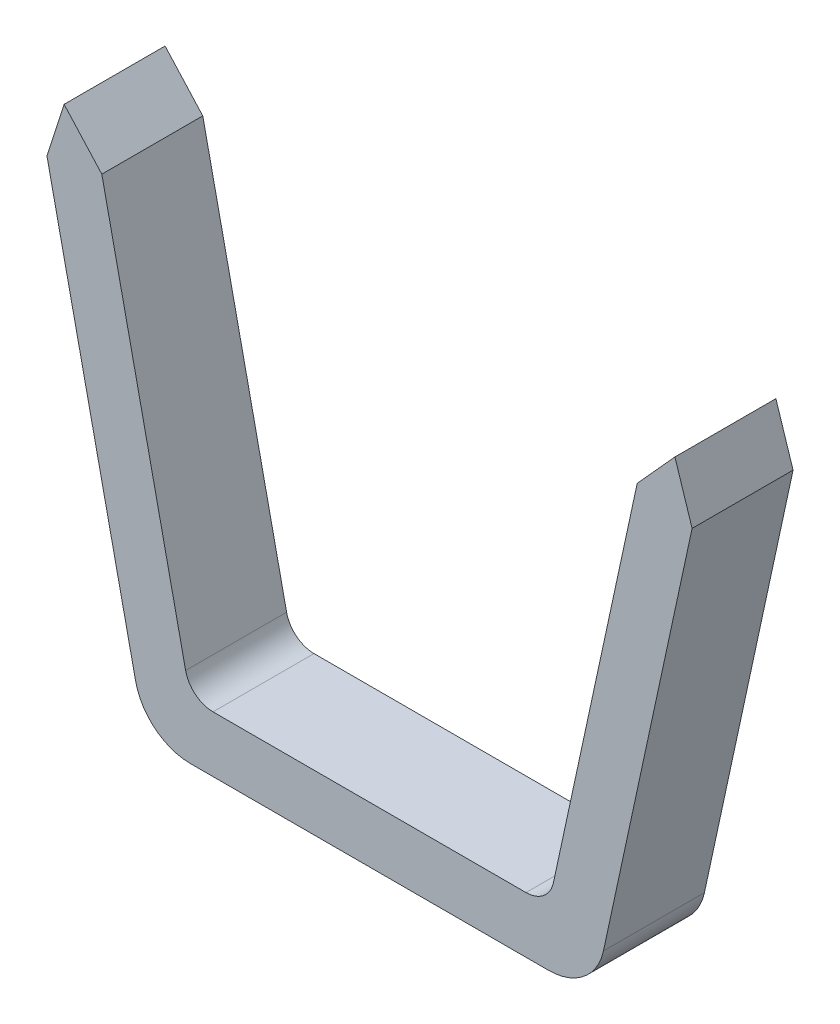
ISO-10303-21;
HEADER;
FILE_DESCRIPTION(('STEP AP214'),'2;1');
FILE_NAME('part.step','',(''),(''),'','','');
FILE_SCHEMA(('AUTOMOTIVE_DESIGN { 1 0 10303 214 1 1 1 1 }'));
ENDSEC;
DATA;
#1=APPLICATION_CONTEXT('core data for automotive mechanical design processes');
#2=APPLICATION_PROTOCOL_DEFINITION('international standard','automotive_design',2000,#1);
#3=PRODUCT_CONTEXT('',#1,'mechanical');
#4=PRODUCT('Part','Part','',(#3));
#5=PRODUCT_RELATED_PRODUCT_CATEGORY('part','',(#4));
#6=PRODUCT_DEFINITION_FORMATION('','',#4);
#7=PRODUCT_DEFINITION_CONTEXT('part definition',#1,'design');
#8=PRODUCT_DEFINITION('design','',#6,#7);
#9=PRODUCT_DEFINITION_SHAPE('','',#8);
#10=(LENGTH_UNIT() NAMED_UNIT(*) SI_UNIT(.MILLI.,.METRE.));
#11=(NAMED_UNIT(*) PLANE_ANGLE_UNIT() SI_UNIT($,.RADIAN.));
#12=(NAMED_UNIT(*) SI_UNIT($,.STERADIAN.) SOLID_ANGLE_UNIT());
#13=UNCERTAINTY_MEASURE_WITH_UNIT(LENGTH_MEASURE(1.E-05),#10,'distance_accuracy_value','');
#14=(GEOMETRIC_REPRESENTATION_CONTEXT(3) GLOBAL_UNCERTAINTY_ASSIGNED_CONTEXT((#13)) GLOBAL_UNIT_ASSIGNED_CONTEXT((#10,
#11,#12)) REPRESENTATION_CONTEXT('',''));
#15=CARTESIAN_POINT('',(0.,0.,0.));
#16=DIRECTION('',(0.,0.,1.));
#17=DIRECTION('',(1.,0.,0.));
#18=AXIS2_PLACEMENT_3D('',#15,#16,#17);
#19=CARTESIAN_POINT('',(-31.9298733487398,-112.5,18.));
#20=DIRECTION('',(0.,0.,1.));
#21=DIRECTION('',(1.,0.,0.));
#22=AXIS2_PLACEMENT_3D('',#19,#20,#21);
#23=PLANE('',#22);
#24=DIRECTION('',(0.306672532909785,-0.951815085801174,0.));
#25=VECTOR('',#24,1.);
#26=CARTESIAN_POINT('',(54.4443390688109,-31.9720104377862,18.));
#27=LINE('',#26,#25);
#28=CARTESIAN_POINT('',(54.4443390688109,-31.9720104377862,18.));
#29=VERTEX_POINT('',#28);
#30=CARTESIAN_POINT('',(57.5063561450649,-41.4755483598365,18.));
#31=VERTEX_POINT('',#30);
#32=EDGE_CURVE('E144',#29,#31,#27,.T.);
#33=ORIENTED_EDGE('',*,*,#32,.F.);
#34=DIRECTION('',(0.670959777554308,0.741493747043273,0.));
#35=VECTOR('',#34,1.);
#36=CARTESIAN_POINT('',(47.7244032118376,-39.3983727700264,18.));
#37=LINE('',#36,#35);
#38=CARTESIAN_POINT('',(47.7244032118376,-39.3983727700264,18.));
#39=VERTEX_POINT('',#38);
#40=EDGE_CURVE('E258',#39,#29,#37,.T.);
#41=ORIENTED_EDGE('',*,*,#40,.F.);
#42=DIRECTION('',(0.211189373172623,0.977445164016353,0.));
#43=VECTOR('',#42,1.);
#44=CARTESIAN_POINT('',(31.9298733487398,-112.5,18.));
#45=LINE('',#44,#43);
#46=CARTESIAN_POINT('',(32.7820358431914,-108.555946865863,18.));
#47=VERTEX_POINT('',#46);
#48=EDGE_CURVE('E218',#47,#39,#45,.T.);
#49=ORIENTED_EDGE('',*,*,#48,.F.);
#50=CARTESIAN_POINT('',(27.8948100231097,-107.5,18.));
#51=DIRECTION('',(0.,0.,1.));
#52=DIRECTION('',(1.,0.,0.));
#53=AXIS2_PLACEMENT_3D('',#50,#51,#52);
#54=CIRCLE('',#53,5.);
#55=CARTESIAN_POINT('',(27.8948100231097,-112.5,18.));
#56=VERTEX_POINT('',#55);
#57=EDGE_CURVE('E193',#47,#56,#54,.F.);
#58=ORIENTED_EDGE('',*,*,#57,.T.);
#59=DIRECTION('',(1.,0.,0.));
#60=VECTOR('',#59,1.);
#61=CARTESIAN_POINT('',(-31.9298733487398,-112.5,18.));
#62=LINE('',#61,#60);
#63=CARTESIAN_POINT('',(-27.8948100231097,-112.5,18.));
#64=VERTEX_POINT('',#63);
#65=EDGE_CURVE('E215',#64,#56,#62,.T.);
#66=ORIENTED_EDGE('',*,*,#65,.F.);
#67=CARTESIAN_POINT('',(-27.8948100231097,-107.5,18.));
#68=DIRECTION('',(0.,0.,1.));
#69=DIRECTION('',(1.,0.,0.));
#70=AXIS2_PLACEMENT_3D('',#67,#68,#69);
#71=CIRCLE('',#70,5.);
#72=CARTESIAN_POINT('',(-32.7820358431915,-108.555946865863,18.));
#73=VERTEX_POINT('',#72);
#74=EDGE_CURVE('E11',#64,#73,#71,.F.);
#75=ORIENTED_EDGE('',*,*,#74,.T.);
#76=DIRECTION('',(0.211189373172623,-0.977445164016353,0.));
#77=VECTOR('',#76,1.);
#78=CARTESIAN_POINT('',(-31.9298733487398,-112.5,18.));
#79=LINE('',#78,#77);
#80=CARTESIAN_POINT('',(-47.7236876934698,-39.4016843948391,18.));
#81=VERTEX_POINT('',#80);
#82=EDGE_CURVE('E214',#81,#73,#79,.T.);
#83=ORIENTED_EDGE('',*,*,#82,.F.);
#84=DIRECTION('',(0.67089697040122,-0.741550574881083,0.));
#85=VECTOR('',#84,1.);
#86=CARTESIAN_POINT('',(-54.4439824625953,-31.9736609139237,18.));
#87=LINE('',#86,#85);
#88=CARTESIAN_POINT('',(-54.4439824625953,-31.9736609139237,18.));
#89=VERTEX_POINT('',#88);
#90=EDGE_CURVE('E47',#89,#81,#87,.T.);
#91=ORIENTED_EDGE('',*,*,#90,.F.);
#92=DIRECTION('',(0.306753150837407,0.95178910713,0.));
#93=VECTOR('',#92,1.);
#94=CARTESIAN_POINT('',(-57.5063561450649,-41.4755483598365,18.));
#95=LINE('',#94,#93);
#96=CARTESIAN_POINT('',(-57.5063561450649,-41.4755483598365,18.));
#97=VERTEX_POINT('',#96);
#98=EDGE_CURVE('E255',#97,#89,#95,.T.);
#99=ORIENTED_EDGE('',*,*,#98,.F.);
#100=DIRECTION('',(0.211189373172623,-0.977445164016353,0.));
#101=VECTOR('',#100,1.);
#102=CARTESIAN_POINT('',(-73.3083873012264,31.6607970120533,18.));
#103=LINE('',#102,#101);
#104=CARTESIAN_POINT('',(-41.7043249889033,-114.611893731726,18.));
#105=VERTEX_POINT('',#104);
#106=EDGE_CURVE('E152',#97,#105,#103,.T.);
#107=ORIENTED_EDGE('',*,*,#106,.T.);
#108=CARTESIAN_POINT('',(-31.9298733487398,-112.5,18.));
#109=DIRECTION('',(0.,0.,1.));
#110=DIRECTION('',(1.,0.,0.));
#111=AXIS2_PLACEMENT_3D('',#108,#109,#110);
#112=CIRCLE('',#111,10.);
#113=CARTESIAN_POINT('',(-31.9298733487398,-122.5,18.));
#114=VERTEX_POINT('',#113);
#115=EDGE_CURVE('E159',#105,#114,#112,.T.);
#116=ORIENTED_EDGE('',*,*,#115,.T.);
#117=DIRECTION('',(1.,0.,0.));
#118=VECTOR('',#117,1.);
#119=CARTESIAN_POINT('',(-31.9298733487398,-122.5,18.));
#120=LINE('',#119,#118);
#121=CARTESIAN_POINT('',(31.9298733487398,-122.5,18.));
#122=VERTEX_POINT('',#121);
#123=EDGE_CURVE('E163',#114,#122,#120,.T.);
#124=ORIENTED_EDGE('',*,*,#123,.T.);
#125=CARTESIAN_POINT('',(31.9298733487398,-112.5,18.));
#126=DIRECTION('',(0.,0.,1.));
#127=DIRECTION('',(1.,0.,0.));
#128=AXIS2_PLACEMENT_3D('',#125,#126,#127);
#129=CIRCLE('',#128,10.);
#130=CARTESIAN_POINT('',(41.7043249889033,-114.611893731726,18.));
#131=VERTEX_POINT('',#130);
#132=EDGE_CURVE('E229',#122,#131,#129,.T.);
#133=ORIENTED_EDGE('',*,*,#132,.T.);
#134=DIRECTION('',(0.211189373172623,0.977445164016353,0.));
#135=VECTOR('',#134,1.);
#136=CARTESIAN_POINT('',(41.7043249889033,-114.611893731726,18.));
#137=LINE('',#136,#135);
#138=EDGE_CURVE('E231',#131,#31,#137,.T.);
#139=ORIENTED_EDGE('',*,*,#138,.T.);
#140=EDGE_LOOP('',(#33,#41,#49,#58,#66,#75,#83,#91,#99,#107,#116,#124,#133,#139));
#141=FACE_BOUND('',#140,.T.);
#142=ADVANCED_FACE('F32',(#141),#23,.T.);
#143=CARTESIAN_POINT('',(-31.9298733487398,-112.5,0.));
#144=DIRECTION('',(0.,0.,1.));
#145=DIRECTION('',(1.,0.,0.));
#146=AXIS2_PLACEMENT_3D('',#143,#144,#145);
#147=PLANE('',#146);
#148=DIRECTION('',(0.670959777554308,0.741493747043273,0.));
#149=VECTOR('',#148,1.);
#150=CARTESIAN_POINT('',(47.7244032118376,-39.3983727700264,0.));
#151=LINE('',#150,#149);
#152=CARTESIAN_POINT('',(47.7244032118376,-39.3983727700264,0.));
#153=VERTEX_POINT('',#152);
#154=CARTESIAN_POINT('',(54.4443390688109,-31.9720104377862,0.));
#155=VERTEX_POINT('',#154);
#156=EDGE_CURVE('E55',#153,#155,#151,.T.);
#157=ORIENTED_EDGE('',*,*,#156,.T.);
#158=DIRECTION('',(0.306672532909785,-0.951815085801174,0.));
#159=VECTOR('',#158,1.);
#160=CARTESIAN_POINT('',(54.4443390688109,-31.9720104377862,0.));
#161=LINE('',#160,#159);
#162=CARTESIAN_POINT('',(57.5063561450649,-41.4755483598365,0.));
#163=VERTEX_POINT('',#162);
#164=EDGE_CURVE('E153',#155,#163,#161,.T.);
#165=ORIENTED_EDGE('',*,*,#164,.T.);
#166=DIRECTION('',(0.211189373172623,0.977445164016353,0.));
#167=VECTOR('',#166,1.);
#168=CARTESIAN_POINT('',(41.7043249889033,-114.611893731726,0.));
#169=LINE('',#168,#167);
#170=CARTESIAN_POINT('',(41.7043249889033,-114.611893731726,0.));
#171=VERTEX_POINT('',#170);
#172=EDGE_CURVE('E160',#171,#163,#169,.T.);
#173=ORIENTED_EDGE('',*,*,#172,.F.);
#174=CARTESIAN_POINT('',(31.9298733487398,-112.5,0.));
#175=DIRECTION('',(0.,0.,1.));
#176=DIRECTION('',(1.,0.,0.));
#177=AXIS2_PLACEMENT_3D('',#174,#175,#176);
#178=CIRCLE('',#177,10.);
#179=CARTESIAN_POINT('',(31.9298733487398,-122.5,0.));
#180=VERTEX_POINT('',#179);
#181=EDGE_CURVE('E166',#180,#171,#178,.T.);
#182=ORIENTED_EDGE('',*,*,#181,.F.);
#183=DIRECTION('',(1.,0.,0.));
#184=VECTOR('',#183,1.);
#185=CARTESIAN_POINT('',(-31.9298733487398,-122.5,0.));
#186=LINE('',#185,#184);
#187=CARTESIAN_POINT('',(-31.9298733487398,-122.5,0.));
#188=VERTEX_POINT('',#187);
#189=EDGE_CURVE('E236',#188,#180,#186,.T.);
#190=ORIENTED_EDGE('',*,*,#189,.F.);
#191=CARTESIAN_POINT('',(-31.9298733487398,-112.5,0.));
#192=DIRECTION('',(0.,0.,1.));
#193=DIRECTION('',(1.,0.,0.));
#194=AXIS2_PLACEMENT_3D('',#191,#192,#193);
#195=CIRCLE('',#194,10.);
#196=CARTESIAN_POINT('',(-41.7043249889033,-114.611893731726,0.));
#197=VERTEX_POINT('',#196);
#198=EDGE_CURVE('E158',#197,#188,#195,.T.);
#199=ORIENTED_EDGE('',*,*,#198,.F.);
#200=DIRECTION('',(0.211189373172623,-0.977445164016353,0.));
#201=VECTOR('',#200,1.);
#202=CARTESIAN_POINT('',(-73.3083873012264,31.6607970120533,0.));
#203=LINE('',#202,#201);
#204=CARTESIAN_POINT('',(-57.5063561450649,-41.4755483598365,0.));
#205=VERTEX_POINT('',#204);
#206=EDGE_CURVE('E150',#205,#197,#203,.T.);
#207=ORIENTED_EDGE('',*,*,#206,.F.);
#208=DIRECTION('',(0.306753150837407,0.95178910713,0.));
#209=VECTOR('',#208,1.);
#210=CARTESIAN_POINT('',(-57.5063561450649,-41.4755483598365,0.));
#211=LINE('',#210,#209);
#212=CARTESIAN_POINT('',(-54.4439824625953,-31.9736609139237,0.));
#213=VERTEX_POINT('',#212);
#214=EDGE_CURVE('E132',#205,#213,#211,.T.);
#215=ORIENTED_EDGE('',*,*,#214,.T.);
#216=DIRECTION('',(0.67089697040122,-0.741550574881083,0.));
#217=VECTOR('',#216,1.);
#218=CARTESIAN_POINT('',(-54.4439824625953,-31.9736609139237,0.));
#219=LINE('',#218,#217);
#220=CARTESIAN_POINT('',(-47.7236876934698,-39.4016843948391,0.));
#221=VERTEX_POINT('',#220);
#222=EDGE_CURVE('E143',#213,#221,#219,.T.);
#223=ORIENTED_EDGE('',*,*,#222,.T.);
#224=DIRECTION('',(0.211189373172623,-0.977445164016353,0.));
#225=VECTOR('',#224,1.);
#226=CARTESIAN_POINT('',(-31.9298733487398,-112.5,0.));
#227=LINE('',#226,#225);
#228=CARTESIAN_POINT('',(-32.7820358431915,-108.555946865863,0.));
#229=VERTEX_POINT('',#228);
#230=EDGE_CURVE('E199',#221,#229,#227,.T.);
#231=ORIENTED_EDGE('',*,*,#230,.T.);
#232=CARTESIAN_POINT('',(-27.8948100231097,-107.5,0.));
#233=DIRECTION('',(0.,0.,1.));
#234=DIRECTION('',(1.,0.,0.));
#235=AXIS2_PLACEMENT_3D('',#232,#233,#234);
#236=CIRCLE('',#235,5.);
#237=CARTESIAN_POINT('',(-27.8948100231097,-112.5,0.));
#238=VERTEX_POINT('',#237);
#239=EDGE_CURVE('E40',#229,#238,#236,.T.);
#240=ORIENTED_EDGE('',*,*,#239,.T.);
#241=DIRECTION('',(1.,0.,0.));
#242=VECTOR('',#241,1.);
#243=CARTESIAN_POINT('',(-31.9298733487398,-112.5,0.));
#244=LINE('',#243,#242);
#245=CARTESIAN_POINT('',(27.8948100231097,-112.5,0.));
#246=VERTEX_POINT('',#245);
#247=EDGE_CURVE('E197',#238,#246,#244,.T.);
#248=ORIENTED_EDGE('',*,*,#247,.T.);
#249=CARTESIAN_POINT('',(27.8948100231097,-107.5,0.));
#250=DIRECTION('',(0.,0.,1.));
#251=DIRECTION('',(1.,0.,0.));
#252=AXIS2_PLACEMENT_3D('',#249,#250,#251);
#253=CIRCLE('',#252,5.);
#254=CARTESIAN_POINT('',(32.7820358431914,-108.555946865863,0.));
#255=VERTEX_POINT('',#254);
#256=EDGE_CURVE('E191',#246,#255,#253,.T.);
#257=ORIENTED_EDGE('',*,*,#256,.T.);
#258=DIRECTION('',(0.211189373172623,0.977445164016353,0.));
#259=VECTOR('',#258,1.);
#260=CARTESIAN_POINT('',(31.9298733487398,-112.5,0.));
#261=LINE('',#260,#259);
#262=EDGE_CURVE('E208',#255,#153,#261,.T.);
#263=ORIENTED_EDGE('',*,*,#262,.T.);
#264=EDGE_LOOP('',(#157,#165,#173,#182,#190,#199,#207,#215,#223,#231,#240,#248,#257,#263));
#265=FACE_BOUND('',#264,.T.);
#266=ADVANCED_FACE('F156',(#265),#147,.F.);
#267=CARTESIAN_POINT('',(-31.9298733487398,-112.5,18.));
#268=DIRECTION('',(0.,0.,-1.));
#269=DIRECTION('',(-1.,0.,0.));
#270=AXIS2_PLACEMENT_3D('',#267,#268,#269);
#271=CYLINDRICAL_SURFACE('',#270,10.);
#272=ORIENTED_EDGE('',*,*,#198,.T.);
#273=DIRECTION('',(0.,0.,-1.));
#274=VECTOR('',#273,1.);
#275=CARTESIAN_POINT('',(-31.9298733487398,-122.5,18.));
#276=LINE('',#275,#274);
#277=EDGE_CURVE('E178',#114,#188,#276,.T.);
#278=ORIENTED_EDGE('',*,*,#277,.F.);
#279=ORIENTED_EDGE('',*,*,#115,.F.);
#280=DIRECTION('',(0.,0.,-1.));
#281=VECTOR('',#280,1.);
#282=CARTESIAN_POINT('',(-41.7043249889033,-114.611893731726,18.));
#283=LINE('',#282,#281);
#284=EDGE_CURVE('E170',#105,#197,#283,.T.);
#285=ORIENTED_EDGE('',*,*,#284,.T.);
#286=EDGE_LOOP('',(#272,#278,#279,#285));
#287=FACE_BOUND('',#286,.T.);
#288=ADVANCED_FACE('F273',(#287),#271,.T.);
#289=CARTESIAN_POINT('',(-31.9298733487398,-122.5,18.));
#290=DIRECTION('',(0.,1.,0.));
#291=DIRECTION('',(0.,0.,1.));
#292=AXIS2_PLACEMENT_3D('',#289,#290,#291);
#293=PLANE('',#292);
#294=ORIENTED_EDGE('',*,*,#189,.T.);
#295=DIRECTION('',(0.,0.,-1.));
#296=VECTOR('',#295,1.);
#297=CARTESIAN_POINT('',(31.9298733487398,-122.5,18.));
#298=LINE('',#297,#296);
#299=EDGE_CURVE('E175',#122,#180,#298,.T.);
#300=ORIENTED_EDGE('',*,*,#299,.F.);
#301=ORIENTED_EDGE('',*,*,#123,.F.);
#302=ORIENTED_EDGE('',*,*,#277,.T.);
#303=EDGE_LOOP('',(#294,#300,#301,#302));
#304=FACE_BOUND('',#303,.T.);
#305=ADVANCED_FACE('F275',(#304),#293,.F.);
#306=CARTESIAN_POINT('',(31.9298733487398,-112.5,18.));
#307=DIRECTION('',(0.,0.,-1.));
#308=DIRECTION('',(-1.,0.,0.));
#309=AXIS2_PLACEMENT_3D('',#306,#307,#308);
#310=CYLINDRICAL_SURFACE('',#309,10.);
#311=ORIENTED_EDGE('',*,*,#181,.T.);
#312=DIRECTION('',(0.,0.,-1.));
#313=VECTOR('',#312,1.);
#314=CARTESIAN_POINT('',(41.7043249889033,-114.611893731726,18.));
#315=LINE('',#314,#313);
#316=EDGE_CURVE('E172',#131,#171,#315,.T.);
#317=ORIENTED_EDGE('',*,*,#316,.F.);
#318=ORIENTED_EDGE('',*,*,#132,.F.);
#319=ORIENTED_EDGE('',*,*,#299,.T.);
#320=EDGE_LOOP('',(#311,#317,#318,#319));
#321=FACE_BOUND('',#320,.T.);
#322=ADVANCED_FACE('F240',(#321),#310,.T.);
#323=CARTESIAN_POINT('',(41.7043249889033,-114.611893731726,18.));
#324=DIRECTION('',(-0.977445164016353,0.211189373172623,0.));
#325=DIRECTION('',(-0.211189373172623,-0.977445164016353,0.));
#326=AXIS2_PLACEMENT_3D('',#323,#324,#325);
#327=PLANE('',#326);
#328=ORIENTED_EDGE('',*,*,#172,.T.);
#329=DIRECTION('',(0.,0.,1.));
#330=VECTOR('',#329,1.);
#331=CARTESIAN_POINT('',(57.5063561450649,-41.4755483598365,0.));
#332=LINE('',#331,#330);
#333=EDGE_CURVE('E224',#163,#31,#332,.T.);
#334=ORIENTED_EDGE('',*,*,#333,.T.);
#335=ORIENTED_EDGE('',*,*,#138,.F.);
#336=ORIENTED_EDGE('',*,*,#316,.T.);
#337=EDGE_LOOP('',(#328,#334,#335,#336));
#338=FACE_BOUND('',#337,.T.);
#339=ADVANCED_FACE('F246',(#338),#327,.F.);
#340=CARTESIAN_POINT('',(-73.3083873012264,31.6607970120533,18.));
#341=DIRECTION('',(0.977445164016353,0.211189373172623,0.));
#342=DIRECTION('',(-0.211189373172623,0.977445164016353,0.));
#343=AXIS2_PLACEMENT_3D('',#340,#341,#342);
#344=PLANE('',#343);
#345=ORIENTED_EDGE('',*,*,#106,.F.);
#346=DIRECTION('',(0.,0.,1.));
#347=VECTOR('',#346,1.);
#348=CARTESIAN_POINT('',(-57.5063561450649,-41.4755483598365,0.));
#349=LINE('',#348,#347);
#350=EDGE_CURVE('E136',#205,#97,#349,.T.);
#351=ORIENTED_EDGE('',*,*,#350,.F.);
#352=ORIENTED_EDGE('',*,*,#206,.T.);
#353=ORIENTED_EDGE('',*,*,#284,.F.);
#354=EDGE_LOOP('',(#345,#351,#352,#353));
#355=FACE_BOUND('',#354,.T.);
#356=ADVANCED_FACE('F148',(#355),#344,.F.);
#357=CARTESIAN_POINT('',(-31.9298733487398,-112.5,18.));
#358=DIRECTION('',(0.977445164016353,0.211189373172623,0.));
#359=DIRECTION('',(-0.211189373172623,0.977445164016353,0.));
#360=AXIS2_PLACEMENT_3D('',#357,#358,#359);
#361=PLANE('',#360);
#362=DIRECTION('',(0.,0.,1.));
#363=VECTOR('',#362,1.);
#364=CARTESIAN_POINT('',(-47.7236876934698,-39.4016843948391,0.));
#365=LINE('',#364,#363);
#366=EDGE_CURVE('E267',#221,#81,#365,.T.);
#367=ORIENTED_EDGE('',*,*,#366,.T.);
#368=ORIENTED_EDGE('',*,*,#82,.T.);
#369=DIRECTION('',(0.,0.,-1.));
#370=VECTOR('',#369,1.);
#371=CARTESIAN_POINT('',(-32.7820358431915,-108.555946865863,0.));
#372=LINE('',#371,#370);
#373=EDGE_CURVE('E188',#73,#229,#372,.T.);
#374=ORIENTED_EDGE('',*,*,#373,.T.);
#375=ORIENTED_EDGE('',*,*,#230,.F.);
#376=EDGE_LOOP('',(#367,#368,#374,#375));
#377=FACE_BOUND('',#376,.T.);
#378=ADVANCED_FACE('F299',(#377),#361,.T.);
#379=CARTESIAN_POINT('',(-31.9298733487398,-112.5,18.));
#380=DIRECTION('',(0.,1.,0.));
#381=DIRECTION('',(0.,0.,1.));
#382=AXIS2_PLACEMENT_3D('',#379,#380,#381);
#383=PLANE('',#382);
#384=ORIENTED_EDGE('',*,*,#65,.T.);
#385=DIRECTION('',(0.,0.,-1.));
#386=VECTOR('',#385,1.);
#387=CARTESIAN_POINT('',(27.8948100231097,-112.5,0.));
#388=LINE('',#387,#386);
#389=EDGE_CURVE('E183',#56,#246,#388,.T.);
#390=ORIENTED_EDGE('',*,*,#389,.T.);
#391=ORIENTED_EDGE('',*,*,#247,.F.);
#392=DIRECTION('',(0.,0.,-1.));
#393=VECTOR('',#392,1.);
#394=CARTESIAN_POINT('',(-27.8948100231097,-112.5,18.));
#395=LINE('',#394,#393);
#396=EDGE_CURVE('E181',#238,#64,#395,.F.);
#397=ORIENTED_EDGE('',*,*,#396,.T.);
#398=EDGE_LOOP('',(#384,#390,#391,#397));
#399=FACE_BOUND('',#398,.T.);
#400=ADVANCED_FACE('F205',(#399),#383,.T.);
#401=CARTESIAN_POINT('',(31.9298733487398,-112.5,18.));
#402=DIRECTION('',(-0.977445164016353,0.211189373172623,0.));
#403=DIRECTION('',(-0.211189373172623,-0.977445164016353,0.));
#404=AXIS2_PLACEMENT_3D('',#401,#402,#403);
#405=PLANE('',#404);
#406=DIRECTION('',(0.,0.,1.));
#407=VECTOR('',#406,1.);
#408=CARTESIAN_POINT('',(47.7244032118376,-39.3983727700264,0.));
#409=LINE('',#408,#407);
#410=EDGE_CURVE('E265',#153,#39,#409,.T.);
#411=ORIENTED_EDGE('',*,*,#410,.F.);
#412=ORIENTED_EDGE('',*,*,#262,.F.);
#413=DIRECTION('',(0.,0.,-1.));
#414=VECTOR('',#413,1.);
#415=CARTESIAN_POINT('',(32.7820358431914,-108.555946865863,18.));
#416=LINE('',#415,#414);
#417=EDGE_CURVE('E186',#255,#47,#416,.F.);
#418=ORIENTED_EDGE('',*,*,#417,.T.);
#419=ORIENTED_EDGE('',*,*,#48,.T.);
#420=EDGE_LOOP('',(#411,#412,#418,#419));
#421=FACE_BOUND('',#420,.T.);
#422=ADVANCED_FACE('F281',(#421),#405,.T.);
#423=CARTESIAN_POINT('',(27.8948100231097,-107.5,18.));
#424=DIRECTION('',(0.,0.,1.));
#425=DIRECTION('',(1.,0.,0.));
#426=AXIS2_PLACEMENT_3D('',#423,#424,#425);
#427=CYLINDRICAL_SURFACE('',#426,5.);
#428=ORIENTED_EDGE('',*,*,#57,.F.);
#429=ORIENTED_EDGE('',*,*,#417,.F.);
#430=ORIENTED_EDGE('',*,*,#256,.F.);
#431=ORIENTED_EDGE('',*,*,#389,.F.);
#432=EDGE_LOOP('',(#428,#429,#430,#431));
#433=FACE_BOUND('',#432,.T.);
#434=ADVANCED_FACE('F284',(#433),#427,.F.);
#435=CARTESIAN_POINT('',(-27.8948100231097,-107.5,18.));
#436=DIRECTION('',(0.,0.,1.));
#437=DIRECTION('',(1.,0.,0.));
#438=AXIS2_PLACEMENT_3D('',#435,#436,#437);
#439=CYLINDRICAL_SURFACE('',#438,5.);
#440=ORIENTED_EDGE('',*,*,#74,.F.);
#441=ORIENTED_EDGE('',*,*,#396,.F.);
#442=ORIENTED_EDGE('',*,*,#239,.F.);
#443=ORIENTED_EDGE('',*,*,#373,.F.);
#444=EDGE_LOOP('',(#440,#441,#442,#443));
#445=FACE_BOUND('',#444,.T.);
#446=ADVANCED_FACE('F34',(#445),#439,.F.);
#447=CARTESIAN_POINT('',(47.7244032118376,-39.3983727700264,0.));
#448=DIRECTION('',(0.741493747043273,-0.670959777554308,0.));
#449=DIRECTION('',(0.670959777554308,0.741493747043273,0.));
#450=AXIS2_PLACEMENT_3D('',#447,#448,#449);
#451=PLANE('',#450);
#452=ORIENTED_EDGE('',*,*,#40,.T.);
#453=DIRECTION('',(0.,0.,1.));
#454=VECTOR('',#453,1.);
#455=CARTESIAN_POINT('',(54.4443390688109,-31.9720104377862,0.));
#456=LINE('',#455,#454);
#457=EDGE_CURVE('E263',#155,#29,#456,.T.);
#458=ORIENTED_EDGE('',*,*,#457,.F.);
#459=ORIENTED_EDGE('',*,*,#156,.F.);
#460=ORIENTED_EDGE('',*,*,#410,.T.);
#461=EDGE_LOOP('',(#452,#458,#459,#460));
#462=FACE_BOUND('',#461,.T.);
#463=ADVANCED_FACE('F278',(#462),#451,.F.);
#464=CARTESIAN_POINT('',(54.4443390688109,-31.9720104377862,0.));
#465=DIRECTION('',(-0.951815085801174,-0.306672532909785,0.));
#466=DIRECTION('',(0.306672532909785,-0.951815085801174,0.));
#467=AXIS2_PLACEMENT_3D('',#464,#465,#466);
#468=PLANE('',#467);
#469=ORIENTED_EDGE('',*,*,#32,.T.);
#470=ORIENTED_EDGE('',*,*,#333,.F.);
#471=ORIENTED_EDGE('',*,*,#164,.F.);
#472=ORIENTED_EDGE('',*,*,#457,.T.);
#473=EDGE_LOOP('',(#469,#470,#471,#472));
#474=FACE_BOUND('',#473,.T.);
#475=ADVANCED_FACE('F277',(#474),#468,.F.);
#476=CARTESIAN_POINT('',(-54.4439824625953,-31.9736609139237,0.));
#477=DIRECTION('',(-0.741550574881083,-0.670896970401219,0.));
#478=DIRECTION('',(0.67089697040122,-0.741550574881083,0.));
#479=AXIS2_PLACEMENT_3D('',#476,#477,#478);
#480=PLANE('',#479);
#481=ORIENTED_EDGE('',*,*,#90,.T.);
#482=ORIENTED_EDGE('',*,*,#366,.F.);
#483=ORIENTED_EDGE('',*,*,#222,.F.);
#484=DIRECTION('',(0.,0.,1.));
#485=VECTOR('',#484,1.);
#486=CARTESIAN_POINT('',(-54.4439824625953,-31.9736609139237,0.));
#487=LINE('',#486,#485);
#488=EDGE_CURVE('E138',#213,#89,#487,.T.);
#489=ORIENTED_EDGE('',*,*,#488,.T.);
#490=EDGE_LOOP('',(#481,#482,#483,#489));
#491=FACE_BOUND('',#490,.T.);
#492=ADVANCED_FACE('F269',(#491),#480,.F.);
#493=CARTESIAN_POINT('',(-57.5063561450649,-41.4755483598365,0.));
#494=DIRECTION('',(0.95178910713,-0.306753150837407,0.));
#495=DIRECTION('',(0.306753150837407,0.95178910713,0.));
#496=AXIS2_PLACEMENT_3D('',#493,#494,#495);
#497=PLANE('',#496);
#498=ORIENTED_EDGE('',*,*,#98,.T.);
#499=ORIENTED_EDGE('',*,*,#488,.F.);
#500=ORIENTED_EDGE('',*,*,#214,.F.);
#501=ORIENTED_EDGE('',*,*,#350,.T.);
#502=EDGE_LOOP('',(#498,#499,#500,#501));
#503=FACE_BOUND('',#502,.T.);
#504=ADVANCED_FACE('F135',(#503),#497,.F.);
#505=CLOSED_SHELL('',(#142,#266,#288,#305,#322,#339,#356,#378,#400,#422,#434,#446,#463,#475,
#492,#504));
#506=MANIFOLD_SOLID_BREP('B2',#505);
#507=ADVANCED_BREP_SHAPE_REPRESENTATION('',(#18,#506),#14);
#508=SHAPE_DEFINITION_REPRESENTATION(#9,#507);
ENDSEC;
END-ISO-10303-21;
